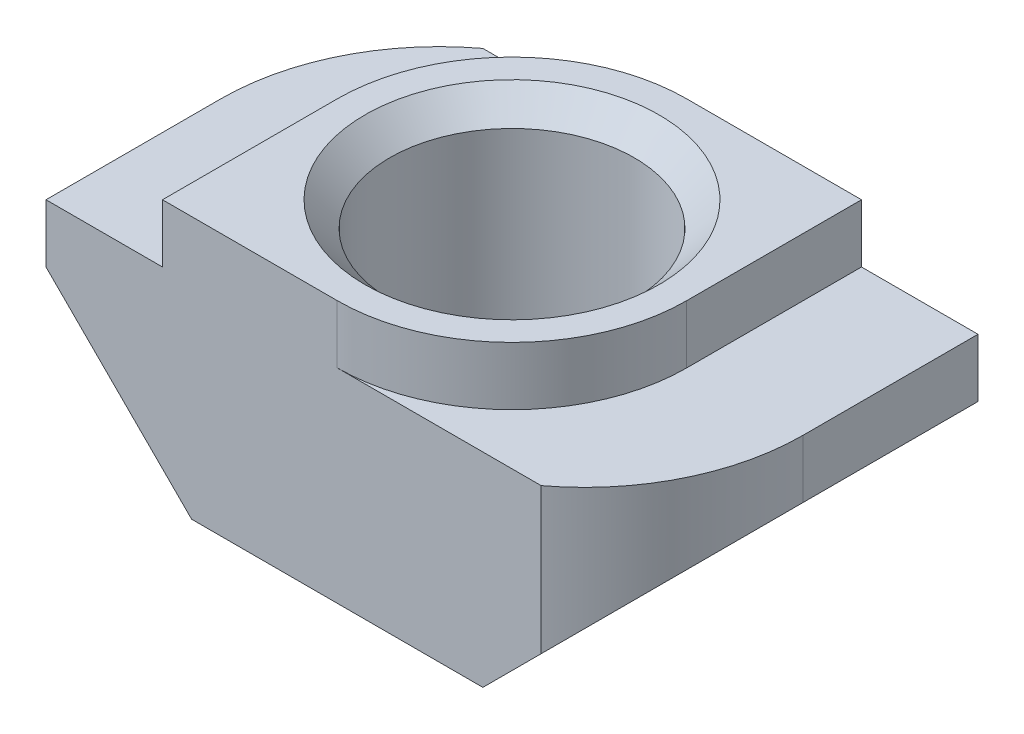
ISO-10303-21;
HEADER;
FILE_DESCRIPTION(('STEP AP214'),'2;1');
FILE_NAME('part.step','',(''),(''),'','','');
FILE_SCHEMA(('AUTOMOTIVE_DESIGN { 1 0 10303 214 1 1 1 1 }'));
ENDSEC;
DATA;
#1=APPLICATION_CONTEXT('core data for automotive mechanical design processes');
#2=APPLICATION_PROTOCOL_DEFINITION('international standard','automotive_design',2000,#1);
#3=PRODUCT_CONTEXT('',#1,'mechanical');
#4=PRODUCT('Part','Part','',(#3));
#5=PRODUCT_RELATED_PRODUCT_CATEGORY('part','',(#4));
#6=PRODUCT_DEFINITION_FORMATION('','',#4);
#7=PRODUCT_DEFINITION_CONTEXT('part definition',#1,'design');
#8=PRODUCT_DEFINITION('design','',#6,#7);
#9=PRODUCT_DEFINITION_SHAPE('','',#8);
#10=(LENGTH_UNIT() NAMED_UNIT(*) SI_UNIT(.MILLI.,.METRE.));
#11=(NAMED_UNIT(*) PLANE_ANGLE_UNIT() SI_UNIT($,.RADIAN.));
#12=(NAMED_UNIT(*) SI_UNIT($,.STERADIAN.) SOLID_ANGLE_UNIT());
#13=UNCERTAINTY_MEASURE_WITH_UNIT(LENGTH_MEASURE(1.E-05),#10,'distance_accuracy_value','');
#14=(GEOMETRIC_REPRESENTATION_CONTEXT(3) GLOBAL_UNCERTAINTY_ASSIGNED_CONTEXT((#13)) GLOBAL_UNIT_ASSIGNED_CONTEXT((#10,
#11,#12)) REPRESENTATION_CONTEXT('',''));
#15=CARTESIAN_POINT('',(0.,0.,0.));
#16=DIRECTION('',(0.,0.,1.));
#17=DIRECTION('',(1.,0.,0.));
#18=AXIS2_PLACEMENT_3D('',#15,#16,#17);
#19=CARTESIAN_POINT('',(0.,4.5,3.));
#20=DIRECTION('',(0.,1.,0.));
#21=DIRECTION('',(0.,0.,1.));
#22=AXIS2_PLACEMENT_3D('',#19,#20,#21);
#23=CYLINDRICAL_SURFACE('',#22,2.1);
#24=CARTESIAN_POINT('',(0.,0.,3.));
#25=DIRECTION('',(0.,1.,0.));
#26=DIRECTION('',(0.,0.,1.));
#27=AXIS2_PLACEMENT_3D('',#24,#25,#26);
#28=CIRCLE('',#27,2.1);
#29=CARTESIAN_POINT('',(0.,0.,5.1));
#30=VERTEX_POINT('',#29);
#31=EDGE_CURVE('E19',#30,#30,#28,.F.);
#32=ORIENTED_EDGE('',*,*,#31,.T.);
#33=EDGE_LOOP('',(#32));
#34=FACE_BOUND('',#33,.T.);
#35=CARTESIAN_POINT('',(0.,4.07500000005712,3.));
#36=DIRECTION('',(0.,1.,0.));
#37=DIRECTION('',(0.,0.,1.));
#38=AXIS2_PLACEMENT_3D('',#35,#36,#37);
#39=CIRCLE('',#38,2.10000000002719);
#40=CARTESIAN_POINT('',(0.,4.07500000005712,5.10000000002719));
#41=VERTEX_POINT('',#40);
#42=EDGE_CURVE('E204',#41,#41,#39,.T.);
#43=ORIENTED_EDGE('',*,*,#42,.T.);
#44=EDGE_LOOP('',(#43));
#45=FACE_BOUND('',#44,.T.);
#46=ADVANCED_FACE('F16',(#34,#45),#23,.F.);
#47=CARTESIAN_POINT('',(-5.,3.5,6.));
#48=DIRECTION('',(1.,0.,0.));
#49=DIRECTION('',(0.,0.,-1.));
#50=AXIS2_PLACEMENT_3D('',#47,#48,#49);
#51=PLANE('',#50);
#52=DIRECTION('',(0.,1.,0.));
#53=VECTOR('',#52,1.);
#54=CARTESIAN_POINT('',(-5.,0.,2.99999999999996));
#55=LINE('',#54,#53);
#56=CARTESIAN_POINT('',(-5.,2.5,2.99999999999998));
#57=VERTEX_POINT('',#56);
#58=CARTESIAN_POINT('',(-5.,3.5,2.99999999999998));
#59=VERTEX_POINT('',#58);
#60=EDGE_CURVE('E208',#57,#59,#55,.T.);
#61=ORIENTED_EDGE('',*,*,#60,.F.);
#62=DIRECTION('',(0.,0.,1.));
#63=VECTOR('',#62,1.);
#64=CARTESIAN_POINT('',(-4.99999999999999,2.49999999999999,6.));
#65=LINE('',#64,#63);
#66=CARTESIAN_POINT('',(-5.,2.5,6.));
#67=VERTEX_POINT('',#66);
#68=EDGE_CURVE('E242',#57,#67,#65,.T.);
#69=ORIENTED_EDGE('',*,*,#68,.T.);
#70=DIRECTION('',(0.,1.,0.));
#71=VECTOR('',#70,1.);
#72=CARTESIAN_POINT('',(-5.,3.5,6.));
#73=LINE('',#72,#71);
#74=CARTESIAN_POINT('',(-5.,3.5,6.));
#75=VERTEX_POINT('',#74);
#76=EDGE_CURVE('E152',#75,#67,#73,.F.);
#77=ORIENTED_EDGE('',*,*,#76,.F.);
#78=DIRECTION('',(0.,0.,-1.));
#79=VECTOR('',#78,1.);
#80=CARTESIAN_POINT('',(-5.,3.5,6.));
#81=LINE('',#80,#79);
#82=EDGE_CURVE('E237',#75,#59,#81,.T.);
#83=ORIENTED_EDGE('',*,*,#82,.T.);
#84=EDGE_LOOP('',(#61,#69,#77,#83));
#85=FACE_BOUND('',#84,.T.);
#86=ADVANCED_FACE('F364',(#85),#51,.F.);
#87=CARTESIAN_POINT('',(-1.25,0.,2.99999999999999));
#88=DIRECTION('',(0.,1.,0.));
#89=DIRECTION('',(0.,0.,1.));
#90=AXIS2_PLACEMENT_3D('',#87,#88,#89);
#91=CYLINDRICAL_SURFACE('',#90,3.75);
#92=DIRECTION('',(0.,1.,0.));
#93=VECTOR('',#92,1.);
#94=CARTESIAN_POINT('',(-3.49999999999998,0.,0.));
#95=LINE('',#94,#93);
#96=CARTESIAN_POINT('',(-3.49999999999999,0.999999999999988,0.));
#97=VERTEX_POINT('',#96);
#98=CARTESIAN_POINT('',(-3.5,3.5,0.));
#99=VERTEX_POINT('',#98);
#100=EDGE_CURVE('E108',#97,#99,#95,.T.);
#101=ORIENTED_EDGE('',*,*,#100,.F.);
#102=CARTESIAN_POINT('',(-1.25,-1.25000000000002,2.99999999999999));
#103=DIRECTION('',(0.707106781186549,0.707106781186546,0.));
#104=DIRECTION('',(-0.707106781186546,0.707106781186549,0.));
#105=AXIS2_PLACEMENT_3D('',#102,#103,#104);
#106=ELLIPSE('',#105,5.30330085889912,3.75);
#107=EDGE_CURVE('E243',#97,#57,#106,.T.);
#108=ORIENTED_EDGE('',*,*,#107,.T.);
#109=ORIENTED_EDGE('',*,*,#60,.T.);
#110=CARTESIAN_POINT('',(-1.25,3.5,2.99999999999999));
#111=DIRECTION('',(0.,1.,0.));
#112=DIRECTION('',(0.,0.,1.));
#113=AXIS2_PLACEMENT_3D('',#110,#111,#112);
#114=CIRCLE('',#113,3.75);
#115=EDGE_CURVE('E234',#59,#99,#114,.F.);
#116=ORIENTED_EDGE('',*,*,#115,.T.);
#117=EDGE_LOOP('',(#101,#108,#109,#116));
#118=FACE_BOUND('',#117,.T.);
#119=ADVANCED_FACE('F362',(#118),#91,.T.);
#120=CARTESIAN_POINT('',(0.,4.50000000000728,3.));
#121=DIRECTION('',(0.,1.,0.));
#122=DIRECTION('',(0.,0.,1.));
#123=AXIS2_PLACEMENT_3D('',#120,#121,#122);
#124=CONICAL_SURFACE('',#123,2.52499999997735,0.785398163397448);
#125=ORIENTED_EDGE('',*,*,#42,.F.);
#126=EDGE_LOOP('',(#125));
#127=FACE_BOUND('',#126,.T.);
#128=CARTESIAN_POINT('',(0.,4.50000000000728,3.));
#129=DIRECTION('',(0.,1.,0.));
#130=DIRECTION('',(0.,0.,1.));
#131=AXIS2_PLACEMENT_3D('',#128,#129,#130);
#132=CIRCLE('',#131,2.52499999997735);
#133=CARTESIAN_POINT('',(0.,4.50000000000728,5.52499999997735));
#134=VERTEX_POINT('',#133);
#135=EDGE_CURVE('E229',#134,#134,#132,.T.);
#136=ORIENTED_EDGE('',*,*,#135,.T.);
#137=EDGE_LOOP('',(#136));
#138=FACE_BOUND('',#137,.T.);
#139=ADVANCED_FACE('F522',(#127,#138),#124,.F.);
#140=CARTESIAN_POINT('',(-3.,4.5,6.));
#141=DIRECTION('',(1.,0.,0.));
#142=DIRECTION('',(0.,0.,-1.));
#143=AXIS2_PLACEMENT_3D('',#140,#141,#142);
#144=PLANE('',#143);
#145=DIRECTION('',(0.,1.,0.));
#146=VECTOR('',#145,1.);
#147=CARTESIAN_POINT('',(-3.,-0.742640687119286,3.));
#148=LINE('',#147,#146);
#149=CARTESIAN_POINT('',(-3.,3.5,3.));
#150=VERTEX_POINT('',#149);
#151=CARTESIAN_POINT('',(-3.,4.5,3.));
#152=VERTEX_POINT('',#151);
#153=EDGE_CURVE('E290',#150,#152,#148,.T.);
#154=ORIENTED_EDGE('',*,*,#153,.F.);
#155=DIRECTION('',(0.,0.,-1.));
#156=VECTOR('',#155,1.);
#157=CARTESIAN_POINT('',(-3.,3.5,6.));
#158=LINE('',#157,#156);
#159=CARTESIAN_POINT('',(-3.,3.5,6.));
#160=VERTEX_POINT('',#159);
#161=EDGE_CURVE('E241',#150,#160,#158,.F.);
#162=ORIENTED_EDGE('',*,*,#161,.T.);
#163=DIRECTION('',(0.,1.,0.));
#164=VECTOR('',#163,1.);
#165=CARTESIAN_POINT('',(-3.,4.5,6.));
#166=LINE('',#165,#164);
#167=CARTESIAN_POINT('',(-3.,4.5,6.));
#168=VERTEX_POINT('',#167);
#169=EDGE_CURVE('E207',#168,#160,#166,.F.);
#170=ORIENTED_EDGE('',*,*,#169,.F.);
#171=DIRECTION('',(0.,0.,-1.));
#172=VECTOR('',#171,1.);
#173=CARTESIAN_POINT('',(-3.,4.5,6.));
#174=LINE('',#173,#172);
#175=EDGE_CURVE('E228',#168,#152,#174,.T.);
#176=ORIENTED_EDGE('',*,*,#175,.T.);
#177=EDGE_LOOP('',(#154,#162,#170,#176));
#178=FACE_BOUND('',#177,.T.);
#179=ADVANCED_FACE('F350',(#178),#144,.F.);
#180=CARTESIAN_POINT('',(0.,-0.742640687119286,3.00000000000001));
#181=DIRECTION('',(0.,1.,0.));
#182=DIRECTION('',(0.,0.,1.));
#183=AXIS2_PLACEMENT_3D('',#180,#181,#182);
#184=CYLINDRICAL_SURFACE('',#183,3.00000000000001);
#185=DIRECTION('',(0.,1.,0.));
#186=VECTOR('',#185,1.);
#187=CARTESIAN_POINT('',(0.,0.,0.));
#188=LINE('',#187,#186);
#189=CARTESIAN_POINT('',(0.,3.5,0.));
#190=VERTEX_POINT('',#189);
#191=CARTESIAN_POINT('',(0.,4.5,0.));
#192=VERTEX_POINT('',#191);
#193=EDGE_CURVE('E281',#190,#192,#188,.T.);
#194=ORIENTED_EDGE('',*,*,#193,.F.);
#195=CARTESIAN_POINT('',(0.,3.5,3.00000000000001));
#196=DIRECTION('',(0.,1.,0.));
#197=DIRECTION('',(0.,0.,1.));
#198=AXIS2_PLACEMENT_3D('',#195,#196,#197);
#199=CIRCLE('',#198,3.00000000000001);
#200=EDGE_CURVE('E238',#190,#150,#199,.T.);
#201=ORIENTED_EDGE('',*,*,#200,.T.);
#202=ORIENTED_EDGE('',*,*,#153,.T.);
#203=CARTESIAN_POINT('',(0.,4.5,3.00000000000001));
#204=DIRECTION('',(0.,1.,0.));
#205=DIRECTION('',(0.,0.,1.));
#206=AXIS2_PLACEMENT_3D('',#203,#204,#205);
#207=CIRCLE('',#206,3.00000000000001);
#208=EDGE_CURVE('E223',#152,#192,#207,.F.);
#209=ORIENTED_EDGE('',*,*,#208,.T.);
#210=EDGE_LOOP('',(#194,#201,#202,#209));
#211=FACE_BOUND('',#210,.T.);
#212=ADVANCED_FACE('F357',(#211),#184,.T.);
#213=CARTESIAN_POINT('',(0.,-0.742640687119286,3.));
#214=DIRECTION('',(0.,1.,0.));
#215=DIRECTION('',(0.,0.,1.));
#216=AXIS2_PLACEMENT_3D('',#213,#214,#215);
#217=CYLINDRICAL_SURFACE('',#216,3.);
#218=DIRECTION('',(0.,1.,0.));
#219=VECTOR('',#218,1.);
#220=CARTESIAN_POINT('',(0.,-0.742640687119286,6.));
#221=LINE('',#220,#219);
#222=CARTESIAN_POINT('',(0.,4.5,6.));
#223=VERTEX_POINT('',#222);
#224=CARTESIAN_POINT('',(0.,3.5,6.));
#225=VERTEX_POINT('',#224);
#226=EDGE_CURVE('E287',#223,#225,#221,.F.);
#227=ORIENTED_EDGE('',*,*,#226,.T.);
#228=CARTESIAN_POINT('',(0.,3.5,3.));
#229=DIRECTION('',(0.,1.,0.));
#230=DIRECTION('',(0.,0.,1.));
#231=AXIS2_PLACEMENT_3D('',#228,#229,#230);
#232=CIRCLE('',#231,3.);
#233=CARTESIAN_POINT('',(3.,3.5,3.));
#234=VERTEX_POINT('',#233);
#235=EDGE_CURVE('E213',#225,#234,#232,.T.);
#236=ORIENTED_EDGE('',*,*,#235,.T.);
#237=DIRECTION('',(0.,1.,0.));
#238=VECTOR('',#237,1.);
#239=CARTESIAN_POINT('',(3.,4.5,3.));
#240=LINE('',#239,#238);
#241=CARTESIAN_POINT('',(3.,4.5,3.));
#242=VERTEX_POINT('',#241);
#243=EDGE_CURVE('E284',#234,#242,#240,.T.);
#244=ORIENTED_EDGE('',*,*,#243,.T.);
#245=CARTESIAN_POINT('',(0.,4.5,3.));
#246=DIRECTION('',(0.,1.,0.));
#247=DIRECTION('',(0.,0.,1.));
#248=AXIS2_PLACEMENT_3D('',#245,#246,#247);
#249=CIRCLE('',#248,3.);
#250=EDGE_CURVE('E218',#242,#223,#249,.F.);
#251=ORIENTED_EDGE('',*,*,#250,.T.);
#252=EDGE_LOOP('',(#227,#236,#244,#251));
#253=FACE_BOUND('',#252,.T.);
#254=ADVANCED_FACE('F368',(#253),#217,.T.);
#255=CARTESIAN_POINT('',(3.,4.5,6.));
#256=DIRECTION('',(-1.,0.,0.));
#257=DIRECTION('',(0.,0.,1.));
#258=AXIS2_PLACEMENT_3D('',#255,#256,#257);
#259=PLANE('',#258);
#260=ORIENTED_EDGE('',*,*,#243,.F.);
#261=DIRECTION('',(0.,0.,-1.));
#262=VECTOR('',#261,1.);
#263=CARTESIAN_POINT('',(3.,3.5,6.));
#264=LINE('',#263,#262);
#265=CARTESIAN_POINT('',(3.,3.5,0.));
#266=VERTEX_POINT('',#265);
#267=EDGE_CURVE('E217',#234,#266,#264,.T.);
#268=ORIENTED_EDGE('',*,*,#267,.T.);
#269=DIRECTION('',(0.,1.,0.));
#270=VECTOR('',#269,1.);
#271=CARTESIAN_POINT('',(3.,0.,0.));
#272=LINE('',#271,#270);
#273=CARTESIAN_POINT('',(3.,4.5,0.));
#274=VERTEX_POINT('',#273);
#275=EDGE_CURVE('E270',#274,#266,#272,.F.);
#276=ORIENTED_EDGE('',*,*,#275,.F.);
#277=DIRECTION('',(0.,0.,-1.));
#278=VECTOR('',#277,1.);
#279=CARTESIAN_POINT('',(3.,4.5,6.));
#280=LINE('',#279,#278);
#281=EDGE_CURVE('E222',#274,#242,#280,.F.);
#282=ORIENTED_EDGE('',*,*,#281,.T.);
#283=EDGE_LOOP('',(#260,#268,#276,#282));
#284=FACE_BOUND('',#283,.T.);
#285=ADVANCED_FACE('F374',(#284),#259,.F.);
#286=CARTESIAN_POINT('',(0.,0.,0.));
#287=DIRECTION('',(0.,0.,-1.));
#288=DIRECTION('',(-1.,0.,0.));
#289=AXIS2_PLACEMENT_3D('',#286,#287,#288);
#290=PLANE('',#289);
#291=DIRECTION('',(1.,0.,0.));
#292=VECTOR('',#291,1.);
#293=CARTESIAN_POINT('',(2.50000000000001,0.,0.));
#294=LINE('',#293,#292);
#295=CARTESIAN_POINT('',(2.50000000000001,0.,0.));
#296=VERTEX_POINT('',#295);
#297=CARTESIAN_POINT('',(-2.50000000000001,0.,0.));
#298=VERTEX_POINT('',#297);
#299=EDGE_CURVE('E119',#296,#298,#294,.F.);
#300=ORIENTED_EDGE('',*,*,#299,.T.);
#301=DIRECTION('',(-0.707106781186546,0.707106781186549,0.));
#302=VECTOR('',#301,1.);
#303=CARTESIAN_POINT('',(-5.,2.5,0.));
#304=LINE('',#303,#302);
#305=EDGE_CURVE('E163',#298,#97,#304,.T.);
#306=ORIENTED_EDGE('',*,*,#305,.T.);
#307=ORIENTED_EDGE('',*,*,#100,.T.);
#308=DIRECTION('',(1.,0.,0.));
#309=VECTOR('',#308,1.);
#310=CARTESIAN_POINT('',(-3.,3.5,0.));
#311=LINE('',#310,#309);
#312=EDGE_CURVE('E233',#99,#190,#311,.T.);
#313=ORIENTED_EDGE('',*,*,#312,.T.);
#314=ORIENTED_EDGE('',*,*,#193,.T.);
#315=DIRECTION('',(1.,0.,0.));
#316=VECTOR('',#315,1.);
#317=CARTESIAN_POINT('',(-3.,4.5,0.));
#318=LINE('',#317,#316);
#319=EDGE_CURVE('E227',#192,#274,#318,.T.);
#320=ORIENTED_EDGE('',*,*,#319,.T.);
#321=ORIENTED_EDGE('',*,*,#275,.T.);
#322=DIRECTION('',(1.,0.,0.));
#323=VECTOR('',#322,1.);
#324=CARTESIAN_POINT('',(3.,3.5,0.));
#325=LINE('',#324,#323);
#326=CARTESIAN_POINT('',(5.,3.5,0.));
#327=VERTEX_POINT('',#326);
#328=EDGE_CURVE('E273',#266,#327,#325,.T.);
#329=ORIENTED_EDGE('',*,*,#328,.T.);
#330=DIRECTION('',(0.,1.,0.));
#331=VECTOR('',#330,1.);
#332=CARTESIAN_POINT('',(5.,3.5,0.));
#333=LINE('',#332,#331);
#334=CARTESIAN_POINT('',(5.,2.5,0.));
#335=VERTEX_POINT('',#334);
#336=EDGE_CURVE('E266',#327,#335,#333,.F.);
#337=ORIENTED_EDGE('',*,*,#336,.T.);
#338=DIRECTION('',(-0.707106781186546,-0.707106781186549,0.));
#339=VECTOR('',#338,1.);
#340=CARTESIAN_POINT('',(5.,2.5,0.));
#341=LINE('',#340,#339);
#342=EDGE_CURVE('E198',#335,#296,#341,.T.);
#343=ORIENTED_EDGE('',*,*,#342,.T.);
#344=EDGE_LOOP('',(#300,#306,#307,#313,#314,#320,#321,#329,#337,#343));
#345=FACE_BOUND('',#344,.T.);
#346=ADVANCED_FACE('F361',(#345),#290,.T.);
#347=CARTESIAN_POINT('',(5.,3.5,6.));
#348=DIRECTION('',(-1.,0.,0.));
#349=DIRECTION('',(0.,0.,1.));
#350=AXIS2_PLACEMENT_3D('',#347,#348,#349);
#351=PLANE('',#350);
#352=DIRECTION('',(0.,1.,0.));
#353=VECTOR('',#352,1.);
#354=CARTESIAN_POINT('',(5.,3.5,3.));
#355=LINE('',#354,#353);
#356=CARTESIAN_POINT('',(5.,2.5,3.));
#357=VERTEX_POINT('',#356);
#358=CARTESIAN_POINT('',(5.,3.5,3.));
#359=VERTEX_POINT('',#358);
#360=EDGE_CURVE('E201',#357,#359,#355,.T.);
#361=ORIENTED_EDGE('',*,*,#360,.F.);
#362=DIRECTION('',(0.,0.,1.));
#363=VECTOR('',#362,1.);
#364=CARTESIAN_POINT('',(5.,2.5,6.));
#365=LINE('',#364,#363);
#366=EDGE_CURVE('E254',#357,#335,#365,.F.);
#367=ORIENTED_EDGE('',*,*,#366,.T.);
#368=ORIENTED_EDGE('',*,*,#336,.F.);
#369=DIRECTION('',(0.,0.,-1.));
#370=VECTOR('',#369,1.);
#371=CARTESIAN_POINT('',(5.,3.5,6.));
#372=LINE('',#371,#370);
#373=EDGE_CURVE('E212',#327,#359,#372,.F.);
#374=ORIENTED_EDGE('',*,*,#373,.T.);
#375=EDGE_LOOP('',(#361,#367,#368,#374));
#376=FACE_BOUND('',#375,.T.);
#377=ADVANCED_FACE('F400',(#376),#351,.F.);
#378=CARTESIAN_POINT('',(5.,2.5,6.));
#379=DIRECTION('',(-0.707106781186549,0.707106781186546,0.));
#380=DIRECTION('',(-0.707106781186546,-0.707106781186549,0.));
#381=AXIS2_PLACEMENT_3D('',#378,#379,#380);
#382=PLANE('',#381);
#383=CARTESIAN_POINT('',(1.25,-1.25000000000002,3.));
#384=DIRECTION('',(-0.707106781186549,0.707106781186546,0.));
#385=DIRECTION('',(0.707106781186546,0.707106781186549,0.));
#386=AXIS2_PLACEMENT_3D('',#383,#384,#385);
#387=ELLIPSE('',#386,5.30330085889912,3.75);
#388=CARTESIAN_POINT('',(3.5,0.999999999999994,6.));
#389=VERTEX_POINT('',#388);
#390=EDGE_CURVE('E179',#389,#357,#387,.T.);
#391=ORIENTED_EDGE('',*,*,#390,.F.);
#392=DIRECTION('',(-0.707106781186546,-0.707106781186549,0.));
#393=VECTOR('',#392,1.);
#394=CARTESIAN_POINT('',(5.,2.5,6.));
#395=LINE('',#394,#393);
#396=CARTESIAN_POINT('',(2.50000000000001,0.,6.));
#397=VERTEX_POINT('',#396);
#398=EDGE_CURVE('E39',#397,#389,#395,.F.);
#399=ORIENTED_EDGE('',*,*,#398,.F.);
#400=DIRECTION('',(0.,0.,1.));
#401=VECTOR('',#400,1.);
#402=CARTESIAN_POINT('',(2.50000000000001,0.,6.));
#403=LINE('',#402,#401);
#404=EDGE_CURVE('E177',#397,#296,#403,.F.);
#405=ORIENTED_EDGE('',*,*,#404,.T.);
#406=ORIENTED_EDGE('',*,*,#342,.F.);
#407=ORIENTED_EDGE('',*,*,#366,.F.);
#408=EDGE_LOOP('',(#391,#399,#405,#406,#407));
#409=FACE_BOUND('',#408,.T.);
#410=ADVANCED_FACE('F405',(#409),#382,.F.);
#411=CARTESIAN_POINT('',(2.50000000000001,0.,6.));
#412=DIRECTION('',(0.,1.,0.));
#413=DIRECTION('',(0.,0.,1.));
#414=AXIS2_PLACEMENT_3D('',#411,#412,#413);
#415=PLANE('',#414);
#416=ORIENTED_EDGE('',*,*,#404,.F.);
#417=DIRECTION('',(-1.,0.,0.));
#418=VECTOR('',#417,1.);
#419=CARTESIAN_POINT('',(0.,0.,6.));
#420=LINE('',#419,#418);
#421=CARTESIAN_POINT('',(-2.50000000000001,0.,6.));
#422=VERTEX_POINT('',#421);
#423=EDGE_CURVE('E169',#397,#422,#420,.T.);
#424=ORIENTED_EDGE('',*,*,#423,.T.);
#425=DIRECTION('',(0.,0.,1.));
#426=VECTOR('',#425,1.);
#427=CARTESIAN_POINT('',(-2.50000000000001,0.,6.));
#428=LINE('',#427,#426);
#429=EDGE_CURVE('E159',#422,#298,#428,.F.);
#430=ORIENTED_EDGE('',*,*,#429,.T.);
#431=ORIENTED_EDGE('',*,*,#299,.F.);
#432=EDGE_LOOP('',(#416,#424,#430,#431));
#433=FACE_BOUND('',#432,.T.);
#434=ORIENTED_EDGE('',*,*,#31,.F.);
#435=EDGE_LOOP('',(#434));
#436=FACE_BOUND('',#435,.T.);
#437=ADVANCED_FACE('F174',(#433,#436),#415,.F.);
#438=CARTESIAN_POINT('',(-5.,2.5,6.));
#439=DIRECTION('',(0.707106781186549,0.707106781186546,0.));
#440=DIRECTION('',(-0.707106781186546,0.707106781186549,0.));
#441=AXIS2_PLACEMENT_3D('',#438,#439,#440);
#442=PLANE('',#441);
#443=ORIENTED_EDGE('',*,*,#107,.F.);
#444=ORIENTED_EDGE('',*,*,#305,.F.);
#445=ORIENTED_EDGE('',*,*,#429,.F.);
#446=DIRECTION('',(-0.707106781186546,0.707106781186549,0.));
#447=VECTOR('',#446,1.);
#448=CARTESIAN_POINT('',(-2.50000000000001,0.,6.));
#449=LINE('',#448,#447);
#450=EDGE_CURVE('E162',#422,#67,#449,.T.);
#451=ORIENTED_EDGE('',*,*,#450,.T.);
#452=ORIENTED_EDGE('',*,*,#68,.F.);
#453=EDGE_LOOP('',(#443,#444,#445,#451,#452));
#454=FACE_BOUND('',#453,.T.);
#455=ADVANCED_FACE('F160',(#454),#442,.F.);
#456=CARTESIAN_POINT('',(-3.,3.5,6.));
#457=DIRECTION('',(0.,-1.,0.));
#458=DIRECTION('',(0.,0.,-1.));
#459=AXIS2_PLACEMENT_3D('',#456,#457,#458);
#460=PLANE('',#459);
#461=ORIENTED_EDGE('',*,*,#115,.F.);
#462=ORIENTED_EDGE('',*,*,#82,.F.);
#463=DIRECTION('',(-1.,0.,0.));
#464=VECTOR('',#463,1.);
#465=CARTESIAN_POINT('',(0.,3.5,6.));
#466=LINE('',#465,#464);
#467=EDGE_CURVE('E171',#75,#160,#466,.F.);
#468=ORIENTED_EDGE('',*,*,#467,.T.);
#469=ORIENTED_EDGE('',*,*,#161,.F.);
#470=ORIENTED_EDGE('',*,*,#200,.F.);
#471=ORIENTED_EDGE('',*,*,#312,.F.);
#472=EDGE_LOOP('',(#461,#462,#468,#469,#470,#471));
#473=FACE_BOUND('',#472,.T.);
#474=ADVANCED_FACE('F353',(#473),#460,.F.);
#475=CARTESIAN_POINT('',(-3.,4.5,6.));
#476=DIRECTION('',(0.,-1.,0.));
#477=DIRECTION('',(0.,0.,-1.));
#478=AXIS2_PLACEMENT_3D('',#475,#476,#477);
#479=PLANE('',#478);
#480=ORIENTED_EDGE('',*,*,#250,.F.);
#481=ORIENTED_EDGE('',*,*,#281,.F.);
#482=ORIENTED_EDGE('',*,*,#319,.F.);
#483=ORIENTED_EDGE('',*,*,#208,.F.);
#484=ORIENTED_EDGE('',*,*,#175,.F.);
#485=DIRECTION('',(-1.,0.,0.));
#486=VECTOR('',#485,1.);
#487=CARTESIAN_POINT('',(0.,4.5,6.));
#488=LINE('',#487,#486);
#489=EDGE_CURVE('E309',#168,#223,#488,.F.);
#490=ORIENTED_EDGE('',*,*,#489,.T.);
#491=EDGE_LOOP('',(#480,#481,#482,#483,#484,#490));
#492=FACE_BOUND('',#491,.T.);
#493=ORIENTED_EDGE('',*,*,#135,.F.);
#494=EDGE_LOOP('',(#493));
#495=FACE_BOUND('',#494,.T.);
#496=ADVANCED_FACE('F371',(#492,#495),#479,.F.);
#497=CARTESIAN_POINT('',(3.,3.5,6.));
#498=DIRECTION('',(0.,-1.,0.));
#499=DIRECTION('',(0.,0.,-1.));
#500=AXIS2_PLACEMENT_3D('',#497,#498,#499);
#501=PLANE('',#500);
#502=CARTESIAN_POINT('',(1.25,3.5,3.));
#503=DIRECTION('',(0.,1.,0.));
#504=DIRECTION('',(0.,0.,1.));
#505=AXIS2_PLACEMENT_3D('',#502,#503,#504);
#506=CIRCLE('',#505,3.75);
#507=CARTESIAN_POINT('',(3.5,3.5,6.));
#508=VERTEX_POINT('',#507);
#509=EDGE_CURVE('E186',#359,#508,#506,.F.);
#510=ORIENTED_EDGE('',*,*,#509,.F.);
#511=ORIENTED_EDGE('',*,*,#373,.F.);
#512=ORIENTED_EDGE('',*,*,#328,.F.);
#513=ORIENTED_EDGE('',*,*,#267,.F.);
#514=ORIENTED_EDGE('',*,*,#235,.F.);
#515=DIRECTION('',(-1.,0.,0.));
#516=VECTOR('',#515,1.);
#517=CARTESIAN_POINT('',(0.,3.5,6.));
#518=LINE('',#517,#516);
#519=EDGE_CURVE('E26',#225,#508,#518,.F.);
#520=ORIENTED_EDGE('',*,*,#519,.T.);
#521=EDGE_LOOP('',(#510,#511,#512,#513,#514,#520));
#522=FACE_BOUND('',#521,.T.);
#523=ADVANCED_FACE('F392',(#522),#501,.F.);
#524=CARTESIAN_POINT('',(1.25,0.,3.));
#525=DIRECTION('',(0.,1.,0.));
#526=DIRECTION('',(0.,0.,1.));
#527=AXIS2_PLACEMENT_3D('',#524,#525,#526);
#528=CYLINDRICAL_SURFACE('',#527,3.75);
#529=DIRECTION('',(0.,1.,0.));
#530=VECTOR('',#529,1.);
#531=CARTESIAN_POINT('',(3.5,0.,6.));
#532=LINE('',#531,#530);
#533=EDGE_CURVE('E11',#508,#389,#532,.F.);
#534=ORIENTED_EDGE('',*,*,#533,.T.);
#535=ORIENTED_EDGE('',*,*,#390,.T.);
#536=ORIENTED_EDGE('',*,*,#360,.T.);
#537=ORIENTED_EDGE('',*,*,#509,.T.);
#538=EDGE_LOOP('',(#534,#535,#536,#537));
#539=FACE_BOUND('',#538,.T.);
#540=ADVANCED_FACE('F403',(#539),#528,.T.);
#541=CARTESIAN_POINT('',(0.,0.,6.));
#542=DIRECTION('',(0.,0.,-1.));
#543=DIRECTION('',(-1.,0.,0.));
#544=AXIS2_PLACEMENT_3D('',#541,#542,#543);
#545=PLANE('',#544);
#546=ORIENTED_EDGE('',*,*,#533,.F.);
#547=ORIENTED_EDGE('',*,*,#519,.F.);
#548=ORIENTED_EDGE('',*,*,#226,.F.);
#549=ORIENTED_EDGE('',*,*,#489,.F.);
#550=ORIENTED_EDGE('',*,*,#169,.T.);
#551=ORIENTED_EDGE('',*,*,#467,.F.);
#552=ORIENTED_EDGE('',*,*,#76,.T.);
#553=ORIENTED_EDGE('',*,*,#450,.F.);
#554=ORIENTED_EDGE('',*,*,#423,.F.);
#555=ORIENTED_EDGE('',*,*,#398,.T.);
#556=EDGE_LOOP('',(#546,#547,#548,#549,#550,#551,#552,#553,#554,#555));
#557=FACE_BOUND('',#556,.T.);
#558=ADVANCED_FACE('F168',(#557),#545,.F.);
#559=CLOSED_SHELL('',(#46,#86,#119,#139,#179,#212,#254,#285,#346,#377,#410,#437,#455,#474,#496,
#523,#540,#558));
#560=MANIFOLD_SOLID_BREP('B1',#559);
#561=ADVANCED_BREP_SHAPE_REPRESENTATION('',(#18,#560),#14);
#562=SHAPE_DEFINITION_REPRESENTATION(#9,#561);
ENDSEC;
END-ISO-10303-21;
